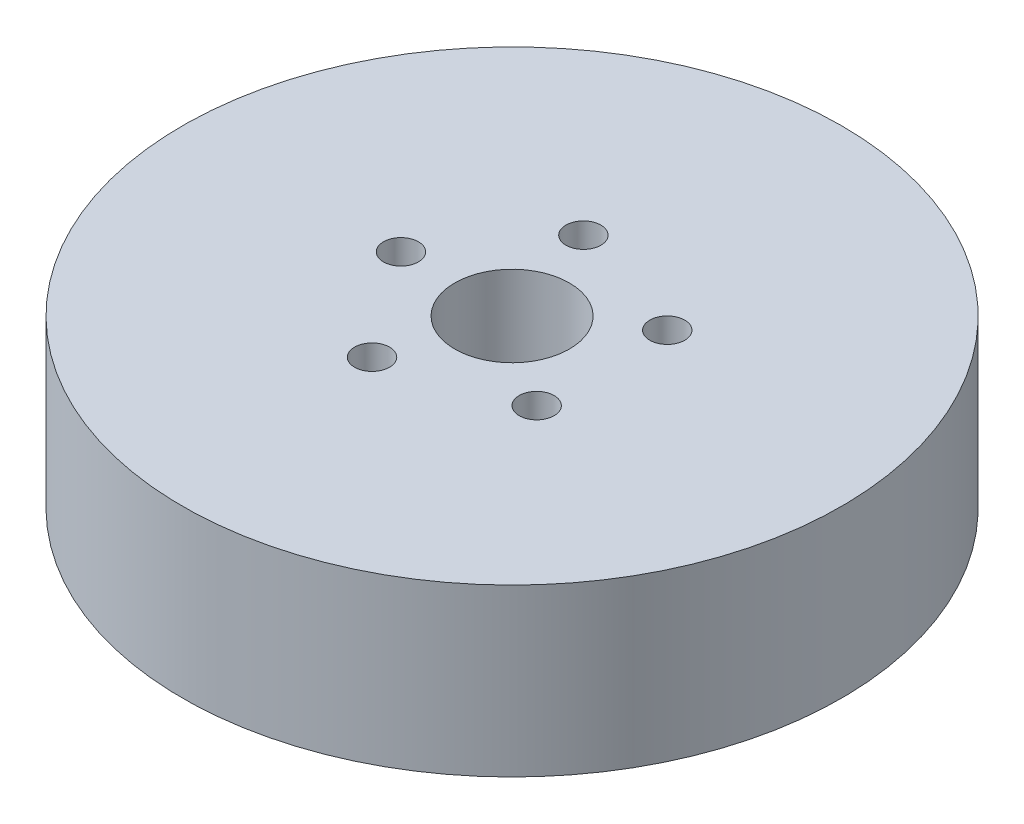
ISO-10303-21;
HEADER;
FILE_DESCRIPTION(('STEP AP214'),'2;1');
FILE_NAME('part.step','',(''),(''),'','','');
FILE_SCHEMA(('AUTOMOTIVE_DESIGN { 1 0 10303 214 1 1 1 1 }'));
ENDSEC;
DATA;
#1=APPLICATION_CONTEXT('core data for automotive mechanical design processes');
#2=APPLICATION_PROTOCOL_DEFINITION('international standard','automotive_design',2000,#1);
#3=PRODUCT_CONTEXT('',#1,'mechanical');
#4=PRODUCT('Part','Part','',(#3));
#5=PRODUCT_RELATED_PRODUCT_CATEGORY('part','',(#4));
#6=PRODUCT_DEFINITION_FORMATION('','',#4);
#7=PRODUCT_DEFINITION_CONTEXT('part definition',#1,'design');
#8=PRODUCT_DEFINITION('design','',#6,#7);
#9=PRODUCT_DEFINITION_SHAPE('','',#8);
#10=(LENGTH_UNIT() NAMED_UNIT(*) SI_UNIT(.MILLI.,.METRE.));
#11=(NAMED_UNIT(*) PLANE_ANGLE_UNIT() SI_UNIT($,.RADIAN.));
#12=(NAMED_UNIT(*) SI_UNIT($,.STERADIAN.) SOLID_ANGLE_UNIT());
#13=UNCERTAINTY_MEASURE_WITH_UNIT(LENGTH_MEASURE(1.E-05),#10,'distance_accuracy_value','');
#14=(GEOMETRIC_REPRESENTATION_CONTEXT(3) GLOBAL_UNCERTAINTY_ASSIGNED_CONTEXT((#13)) GLOBAL_UNIT_ASSIGNED_CONTEXT((#10,
#11,#12)) REPRESENTATION_CONTEXT('',''));
#15=CARTESIAN_POINT('',(0.,0.,0.));
#16=DIRECTION('',(0.,0.,1.));
#17=DIRECTION('',(1.,0.,0.));
#18=AXIS2_PLACEMENT_3D('',#15,#16,#17);
#19=CARTESIAN_POINT('',(0.,29.,0.));
#20=DIRECTION('',(0.,-1.,0.));
#21=DIRECTION('',(0.,0.,-1.));
#22=AXIS2_PLACEMENT_3D('',#19,#20,#21);
#23=CYLINDRICAL_SURFACE('',#22,57.5);
#24=CARTESIAN_POINT('',(0.,29.,0.));
#25=DIRECTION('',(0.,1.,0.));
#26=DIRECTION('',(0.,0.,1.));
#27=AXIS2_PLACEMENT_3D('',#24,#25,#26);
#28=CIRCLE('',#27,57.5);
#29=CARTESIAN_POINT('',(0.,29.,-57.5));
#30=VERTEX_POINT('',#29);
#31=EDGE_CURVE('E10',#30,#30,#28,.T.);
#32=CARTESIAN_POINT('',(0.,0.,0.));
#33=DIRECTION('',(0.,1.,0.));
#34=DIRECTION('',(0.,0.,1.));
#35=AXIS2_PLACEMENT_3D('',#32,#33,#34);
#36=CIRCLE('',#35,57.5);
#37=CARTESIAN_POINT('',(0.,0.,-57.5));
#38=VERTEX_POINT('',#37);
#39=EDGE_CURVE('E37',#38,#38,#36,.T.);
#40=CARTESIAN_POINT('',(0.,29.,-57.5));
#41=CARTESIAN_POINT('',(0.,28.6979166666667,-57.5));
#42=CARTESIAN_POINT('',(0.,28.3958333333333,-57.5));
#43=CARTESIAN_POINT('',(0.,27.7916666666667,-57.5));
#44=CARTESIAN_POINT('',(0.,27.4895833333333,-57.5));
#45=CARTESIAN_POINT('',(0.,26.8854166666667,-57.5));
#46=CARTESIAN_POINT('',(0.,26.5833333333333,-57.5));
#47=CARTESIAN_POINT('',(0.,25.9791666666667,-57.5));
#48=CARTESIAN_POINT('',(0.,25.6770833333333,-57.5));
#49=CARTESIAN_POINT('',(0.,25.0729166666667,-57.5));
#50=CARTESIAN_POINT('',(0.,24.7708333333333,-57.5));
#51=CARTESIAN_POINT('',(0.,24.1666666666667,-57.5));
#52=CARTESIAN_POINT('',(0.,23.8645833333333,-57.5));
#53=CARTESIAN_POINT('',(0.,23.2604166666667,-57.5));
#54=CARTESIAN_POINT('',(0.,22.9583333333333,-57.5));
#55=CARTESIAN_POINT('',(0.,22.3541666666667,-57.5));
#56=CARTESIAN_POINT('',(0.,22.0520833333333,-57.5));
#57=CARTESIAN_POINT('',(0.,21.4479166666667,-57.5));
#58=CARTESIAN_POINT('',(0.,21.1458333333333,-57.5));
#59=CARTESIAN_POINT('',(0.,20.5416666666667,-57.5));
#60=CARTESIAN_POINT('',(0.,20.2395833333333,-57.5));
#61=CARTESIAN_POINT('',(0.,19.6354166666667,-57.5));
#62=CARTESIAN_POINT('',(0.,19.3333333333333,-57.5));
#63=CARTESIAN_POINT('',(0.,18.7291666666667,-57.5));
#64=CARTESIAN_POINT('',(0.,18.4270833333333,-57.5));
#65=CARTESIAN_POINT('',(0.,17.8229166666667,-57.5));
#66=CARTESIAN_POINT('',(0.,17.5208333333333,-57.5));
#67=CARTESIAN_POINT('',(0.,16.9166666666667,-57.5));
#68=CARTESIAN_POINT('',(0.,16.6145833333333,-57.5));
#69=CARTESIAN_POINT('',(0.,16.0104166666667,-57.5));
#70=CARTESIAN_POINT('',(0.,15.7083333333333,-57.5));
#71=CARTESIAN_POINT('',(0.,15.1041666666667,-57.5));
#72=CARTESIAN_POINT('',(0.,14.8020833333333,-57.5));
#73=CARTESIAN_POINT('',(0.,14.1979166666667,-57.5));
#74=CARTESIAN_POINT('',(0.,13.8958333333333,-57.5));
#75=CARTESIAN_POINT('',(0.,13.2916666666667,-57.5));
#76=CARTESIAN_POINT('',(0.,12.9895833333333,-57.5));
#77=CARTESIAN_POINT('',(0.,12.3854166666667,-57.5));
#78=CARTESIAN_POINT('',(0.,12.0833333333333,-57.5));
#79=CARTESIAN_POINT('',(0.,11.4791666666667,-57.5));
#80=CARTESIAN_POINT('',(0.,11.1770833333333,-57.5));
#81=CARTESIAN_POINT('',(0.,10.5729166666667,-57.5));
#82=CARTESIAN_POINT('',(0.,10.2708333333333,-57.5));
#83=CARTESIAN_POINT('',(0.,9.66666666666667,-57.5));
#84=CARTESIAN_POINT('',(0.,9.36458333333333,-57.5));
#85=CARTESIAN_POINT('',(0.,8.76041666666667,-57.5));
#86=CARTESIAN_POINT('',(0.,8.45833333333333,-57.5));
#87=CARTESIAN_POINT('',(0.,7.85416666666667,-57.5));
#88=CARTESIAN_POINT('',(0.,7.55208333333333,-57.5));
#89=CARTESIAN_POINT('',(0.,6.94791666666667,-57.5));
#90=CARTESIAN_POINT('',(0.,6.64583333333333,-57.5));
#91=CARTESIAN_POINT('',(0.,6.04166666666667,-57.5));
#92=CARTESIAN_POINT('',(0.,5.73958333333333,-57.5));
#93=CARTESIAN_POINT('',(0.,5.13541666666667,-57.5));
#94=CARTESIAN_POINT('',(0.,4.83333333333333,-57.5));
#95=CARTESIAN_POINT('',(0.,4.22916666666667,-57.5));
#96=CARTESIAN_POINT('',(0.,3.92708333333333,-57.5));
#97=CARTESIAN_POINT('',(0.,3.32291666666667,-57.5));
#98=CARTESIAN_POINT('',(0.,3.02083333333333,-57.5));
#99=CARTESIAN_POINT('',(0.,2.41666666666667,-57.5));
#100=CARTESIAN_POINT('',(0.,2.11458333333333,-57.5));
#101=CARTESIAN_POINT('',(0.,1.51041666666667,-57.5));
#102=CARTESIAN_POINT('',(0.,1.20833333333333,-57.5));
#103=CARTESIAN_POINT('',(0.,0.604166666666667,-57.5));
#104=CARTESIAN_POINT('',(0.,0.302083333333333,-57.5));
#105=CARTESIAN_POINT('',(0.,0.,-57.5));
#106=B_SPLINE_CURVE_WITH_KNOTS('',3,(#40,#41,#42,#43,#44,#45,#46,#47,#48,#49,#50,#51,#52,#53,
#54,#55,#56,#57,#58,#59,#60,#61,#62,#63,#64,#65,#66,#67,#68,#69,#70,#71,#72,#73,#74,#75,#76,#77,
#78,#79,#80,#81,#82,#83,#84,#85,#86,#87,#88,#89,#90,#91,#92,#93,#94,#95,#96,#97,#98,#99,#100,
#101,#102,#103,#104,#105),.UNSPECIFIED.,.F.,.F.,(4,2,2,2,2,2,2,2,2,2,2,2,2,2,2,2,2,2,2,2,2,2,2,
2,2,2,2,2,2,2,2,2,4),(0.,0.906250000000001,1.8125,2.71875,3.625,4.53125,5.4375,6.34375,7.25,
8.15625,9.0625,9.96875,10.875,11.78125,12.6875,13.59375,14.5,15.40625,16.3125,17.21875,18.125,
19.03125,19.9375,20.84375,21.75,22.65625,23.5625,24.46875,25.375,26.28125,27.1875,28.09375,29.),.UNSPECIFIED.);
#107=EDGE_CURVE('BSEAM40',#30,#38,#106,.T.);
#108=ORIENTED_EDGE('',*,*,#31,.F.);
#109=ORIENTED_EDGE('',*,*,#39,.T.);
#110=ORIENTED_EDGE('',*,*,#107,.T.);
#111=ORIENTED_EDGE('',*,*,#107,.F.);
#112=EDGE_LOOP('',(#108,#110,#109,#111));
#113=FACE_BOUND('',#112,.T.);
#114=ADVANCED_FACE('F40',(#113),#23,.T.);
#115=CARTESIAN_POINT('',(0.,29.,0.));
#116=DIRECTION('',(0.,1.,0.));
#117=DIRECTION('',(0.,0.,1.));
#118=AXIS2_PLACEMENT_3D('',#115,#116,#117);
#119=PLANE('',#118);
#120=CARTESIAN_POINT('',(-5.99086119774764,29.,18.4379748818101));
#121=DIRECTION('',(0.,1.,0.));
#122=DIRECTION('',(0.951056516295155,0.,0.309016994374945));
#123=AXIS2_PLACEMENT_3D('',#120,#121,#122);
#124=CIRCLE('',#123,3.05006748718573);
#125=CARTESIAN_POINT('',(-3.09007463891966,29.,19.380497569341));
#126=VERTEX_POINT('',#125);
#127=EDGE_CURVE('E78',#126,#126,#124,.T.);
#128=ORIENTED_EDGE('',*,*,#127,.F.);
#129=EDGE_LOOP('',(#128));
#130=FACE_BOUND('',#129,.T.);
#131=CARTESIAN_POINT('',(15.6842782375864,29.,11.3952951606754));
#132=DIRECTION('',(0.,1.,0.));
#133=DIRECTION('',(0.587785252292469,0.,-0.809016994374951));
#134=AXIS2_PLACEMENT_3D('',#131,#132,#133);
#135=CIRCLE('',#134,3.05006748718573);
#136=CARTESIAN_POINT('',(17.4770629250509,29.,8.92773872955161));
#137=VERTEX_POINT('',#136);
#138=EDGE_CURVE('E71',#137,#137,#135,.T.);
#139=ORIENTED_EDGE('',*,*,#138,.F.);
#140=EDGE_LOOP('',(#139));
#141=FACE_BOUND('',#140,.T.);
#142=CARTESIAN_POINT('',(15.6842782375862,29.,-11.3952951606756));
#143=DIRECTION('',(0.,1.,0.));
#144=DIRECTION('',(-0.58778525229248,0.,-0.809016994374942));
#145=AXIS2_PLACEMENT_3D('',#142,#143,#144);
#146=CIRCLE('',#145,3.05006748718573);
#147=CARTESIAN_POINT('',(13.8914935501217,29.,-13.8628515917993));
#148=VERTEX_POINT('',#147);
#149=EDGE_CURVE('E70',#148,#148,#146,.T.);
#150=ORIENTED_EDGE('',*,*,#149,.F.);
#151=EDGE_LOOP('',(#150));
#152=FACE_BOUND('',#151,.T.);
#153=CARTESIAN_POINT('',(-5.9908611977479,29.,-18.43797488181));
#154=DIRECTION('',(0.,1.,0.));
#155=DIRECTION('',(-0.95105651629515,0.,0.309016994374958));
#156=AXIS2_PLACEMENT_3D('',#153,#154,#155);
#157=CIRCLE('',#156,3.05006748718573);
#158=CARTESIAN_POINT('',(-8.89164775657586,29.,-17.4954521942791));
#159=VERTEX_POINT('',#158);
#160=EDGE_CURVE('E61',#159,#159,#157,.T.);
#161=ORIENTED_EDGE('',*,*,#160,.F.);
#162=EDGE_LOOP('',(#161));
#163=FACE_BOUND('',#162,.T.);
#164=CARTESIAN_POINT('',(-19.3868340796773,29.,0.));
#165=DIRECTION('',(0.,1.,0.));
#166=DIRECTION('',(0.,0.,1.));
#167=AXIS2_PLACEMENT_3D('',#164,#165,#166);
#168=CIRCLE('',#167,3.05006748718573);
#169=CARTESIAN_POINT('',(-19.3868340796773,29.,3.05006748718573));
#170=VERTEX_POINT('',#169);
#171=EDGE_CURVE('E54',#170,#170,#168,.T.);
#172=ORIENTED_EDGE('',*,*,#171,.F.);
#173=EDGE_LOOP('',(#172));
#174=FACE_BOUND('',#173,.T.);
#175=CARTESIAN_POINT('',(0.,29.,0.));
#176=DIRECTION('',(0.,1.,0.));
#177=DIRECTION('',(0.,0.,1.));
#178=AXIS2_PLACEMENT_3D('',#175,#176,#177);
#179=CIRCLE('',#178,10.);
#180=CARTESIAN_POINT('',(0.,29.,-10.));
#181=VERTEX_POINT('',#180);
#182=EDGE_CURVE('E50',#181,#181,#179,.T.);
#183=ORIENTED_EDGE('',*,*,#182,.F.);
#184=EDGE_LOOP('',(#183));
#185=FACE_BOUND('',#184,.T.);
#186=ORIENTED_EDGE('',*,*,#31,.T.);
#187=EDGE_LOOP('',(#186));
#188=FACE_BOUND('',#187,.T.);
#189=ADVANCED_FACE('F94',(#130,#141,#152,#163,#174,#185,#188),#119,.T.);
#190=CARTESIAN_POINT('',(0.,0.,0.));
#191=DIRECTION('',(0.,1.,0.));
#192=DIRECTION('',(0.,0.,1.));
#193=AXIS2_PLACEMENT_3D('',#190,#191,#192);
#194=PLANE('',#193);
#195=CARTESIAN_POINT('',(0.,0.,0.));
#196=DIRECTION('',(0.,1.,0.));
#197=DIRECTION('',(0.,0.,1.));
#198=AXIS2_PLACEMENT_3D('',#195,#196,#197);
#199=CIRCLE('',#198,10.);
#200=CARTESIAN_POINT('',(0.,0.,-10.));
#201=VERTEX_POINT('',#200);
#202=EDGE_CURVE('E47',#201,#201,#199,.T.);
#203=ORIENTED_EDGE('',*,*,#202,.T.);
#204=EDGE_LOOP('',(#203));
#205=FACE_BOUND('',#204,.T.);
#206=ORIENTED_EDGE('',*,*,#39,.F.);
#207=EDGE_LOOP('',(#206));
#208=FACE_BOUND('',#207,.T.);
#209=ADVANCED_FACE('F100',(#205,#208),#194,.F.);
#210=CARTESIAN_POINT('',(0.,29.,0.));
#211=DIRECTION('',(0.,-1.,0.));
#212=DIRECTION('',(0.,0.,-1.));
#213=AXIS2_PLACEMENT_3D('',#210,#211,#212);
#214=CYLINDRICAL_SURFACE('',#213,10.);
#215=CARTESIAN_POINT('',(0.,29.,-10.));
#216=CARTESIAN_POINT('',(0.,28.6979166666667,-10.));
#217=CARTESIAN_POINT('',(0.,28.3958333333333,-10.));
#218=CARTESIAN_POINT('',(0.,27.7916666666667,-10.));
#219=CARTESIAN_POINT('',(0.,27.4895833333333,-10.));
#220=CARTESIAN_POINT('',(0.,26.8854166666667,-10.));
#221=CARTESIAN_POINT('',(0.,26.5833333333333,-10.));
#222=CARTESIAN_POINT('',(0.,25.9791666666667,-10.));
#223=CARTESIAN_POINT('',(0.,25.6770833333333,-10.));
#224=CARTESIAN_POINT('',(0.,25.0729166666667,-10.));
#225=CARTESIAN_POINT('',(0.,24.7708333333333,-10.));
#226=CARTESIAN_POINT('',(0.,24.1666666666667,-10.));
#227=CARTESIAN_POINT('',(0.,23.8645833333333,-10.));
#228=CARTESIAN_POINT('',(0.,23.2604166666667,-10.));
#229=CARTESIAN_POINT('',(0.,22.9583333333333,-10.));
#230=CARTESIAN_POINT('',(0.,22.3541666666667,-10.));
#231=CARTESIAN_POINT('',(0.,22.0520833333333,-10.));
#232=CARTESIAN_POINT('',(0.,21.4479166666667,-10.));
#233=CARTESIAN_POINT('',(0.,21.1458333333333,-10.));
#234=CARTESIAN_POINT('',(0.,20.5416666666667,-10.));
#235=CARTESIAN_POINT('',(0.,20.2395833333333,-10.));
#236=CARTESIAN_POINT('',(0.,19.6354166666667,-10.));
#237=CARTESIAN_POINT('',(0.,19.3333333333333,-10.));
#238=CARTESIAN_POINT('',(0.,18.7291666666667,-10.));
#239=CARTESIAN_POINT('',(0.,18.4270833333333,-10.));
#240=CARTESIAN_POINT('',(0.,17.8229166666667,-10.));
#241=CARTESIAN_POINT('',(0.,17.5208333333333,-10.));
#242=CARTESIAN_POINT('',(0.,16.9166666666667,-10.));
#243=CARTESIAN_POINT('',(0.,16.6145833333333,-10.));
#244=CARTESIAN_POINT('',(0.,16.0104166666667,-10.));
#245=CARTESIAN_POINT('',(0.,15.7083333333333,-10.));
#246=CARTESIAN_POINT('',(0.,15.1041666666667,-10.));
#247=CARTESIAN_POINT('',(0.,14.8020833333333,-10.));
#248=CARTESIAN_POINT('',(0.,14.1979166666667,-10.));
#249=CARTESIAN_POINT('',(0.,13.8958333333333,-10.));
#250=CARTESIAN_POINT('',(0.,13.2916666666667,-10.));
#251=CARTESIAN_POINT('',(0.,12.9895833333333,-10.));
#252=CARTESIAN_POINT('',(0.,12.3854166666667,-10.));
#253=CARTESIAN_POINT('',(0.,12.0833333333333,-10.));
#254=CARTESIAN_POINT('',(0.,11.4791666666667,-10.));
#255=CARTESIAN_POINT('',(0.,11.1770833333333,-10.));
#256=CARTESIAN_POINT('',(0.,10.5729166666667,-10.));
#257=CARTESIAN_POINT('',(0.,10.2708333333333,-10.));
#258=CARTESIAN_POINT('',(0.,9.66666666666667,-10.));
#259=CARTESIAN_POINT('',(0.,9.36458333333333,-10.));
#260=CARTESIAN_POINT('',(0.,8.76041666666667,-10.));
#261=CARTESIAN_POINT('',(0.,8.45833333333333,-10.));
#262=CARTESIAN_POINT('',(0.,7.85416666666667,-10.));
#263=CARTESIAN_POINT('',(0.,7.55208333333333,-10.));
#264=CARTESIAN_POINT('',(0.,6.94791666666667,-10.));
#265=CARTESIAN_POINT('',(0.,6.64583333333333,-10.));
#266=CARTESIAN_POINT('',(0.,6.04166666666667,-10.));
#267=CARTESIAN_POINT('',(0.,5.73958333333333,-10.));
#268=CARTESIAN_POINT('',(0.,5.13541666666667,-10.));
#269=CARTESIAN_POINT('',(0.,4.83333333333333,-10.));
#270=CARTESIAN_POINT('',(0.,4.22916666666667,-10.));
#271=CARTESIAN_POINT('',(0.,3.92708333333333,-10.));
#272=CARTESIAN_POINT('',(0.,3.32291666666667,-10.));
#273=CARTESIAN_POINT('',(0.,3.02083333333333,-10.));
#274=CARTESIAN_POINT('',(0.,2.41666666666667,-10.));
#275=CARTESIAN_POINT('',(0.,2.11458333333333,-10.));
#276=CARTESIAN_POINT('',(0.,1.51041666666667,-10.));
#277=CARTESIAN_POINT('',(0.,1.20833333333333,-10.));
#278=CARTESIAN_POINT('',(0.,0.604166666666667,-10.));
#279=CARTESIAN_POINT('',(0.,0.302083333333333,-10.));
#280=CARTESIAN_POINT('',(0.,0.,-10.));
#281=B_SPLINE_CURVE_WITH_KNOTS('',3,(#215,#216,#217,#218,#219,#220,#221,#222,#223,#224,#225,
#226,#227,#228,#229,#230,#231,#232,#233,#234,#235,#236,#237,#238,#239,#240,#241,#242,#243,#244,
#245,#246,#247,#248,#249,#250,#251,#252,#253,#254,#255,#256,#257,#258,#259,#260,#261,#262,#263,
#264,#265,#266,#267,#268,#269,#270,#271,#272,#273,#274,#275,#276,#277,#278,#279,#280),
.UNSPECIFIED.,.F.,.F.,(4,2,2,2,2,2,2,2,2,2,2,2,2,2,2,2,2,2,2,2,2,2,2,2,2,2,2,2,2,2,2,2,4),(0.,
0.906250000000001,1.8125,2.71875,3.625,4.53125,5.4375,6.34375,7.25,8.15625,9.0625,9.96875,
10.875,11.78125,12.6875,13.59375,14.5,15.40625,16.3125,17.21875,18.125,19.03125,19.9375,
20.84375,21.75,22.65625,23.5625,24.46875,25.375,26.28125,27.1875,28.09375,29.),.UNSPECIFIED.);
#282=EDGE_CURVE('BSEAM108',#181,#201,#281,.T.);
#283=ORIENTED_EDGE('',*,*,#182,.T.);
#284=ORIENTED_EDGE('',*,*,#202,.F.);
#285=ORIENTED_EDGE('',*,*,#282,.T.);
#286=ORIENTED_EDGE('',*,*,#282,.F.);
#287=EDGE_LOOP('',(#283,#285,#284,#286));
#288=FACE_BOUND('',#287,.T.);
#289=ADVANCED_FACE('F108',(#288),#214,.F.);
#290=CARTESIAN_POINT('',(-19.3868340796773,10.1873380767061,0.));
#291=DIRECTION('',(0.,1.,0.));
#292=DIRECTION('',(0.,0.,1.));
#293=AXIS2_PLACEMENT_3D('',#290,#291,#292);
#294=CYLINDRICAL_SURFACE('',#293,3.05006748718573);
#295=CARTESIAN_POINT('',(-19.3868340796773,10.1873380767061,0.));
#296=DIRECTION('',(0.,1.,0.));
#297=DIRECTION('',(0.,0.,1.));
#298=AXIS2_PLACEMENT_3D('',#295,#296,#297);
#299=CIRCLE('',#298,3.05006748718573);
#300=CARTESIAN_POINT('',(-19.3868340796773,10.1873380767061,3.05006748718573));
#301=VERTEX_POINT('',#300);
#302=EDGE_CURVE('E55',#301,#301,#299,.T.);
#303=ORIENTED_EDGE('',*,*,#302,.F.);
#304=EDGE_LOOP('',(#303));
#305=FACE_BOUND('',#304,.T.);
#306=ORIENTED_EDGE('',*,*,#171,.T.);
#307=EDGE_LOOP('',(#306));
#308=FACE_BOUND('',#307,.T.);
#309=ADVANCED_FACE('F115',(#305,#308),#294,.F.);
#310=CARTESIAN_POINT('',(-19.3868340796773,10.1873380767061,0.));
#311=DIRECTION('',(0.,1.,0.));
#312=DIRECTION('',(0.,0.,1.));
#313=AXIS2_PLACEMENT_3D('',#310,#311,#312);
#314=PLANE('',#313);
#315=ORIENTED_EDGE('',*,*,#302,.T.);
#316=EDGE_LOOP('',(#315));
#317=FACE_BOUND('',#316,.T.);
#318=ADVANCED_FACE('F142',(#317),#314,.T.);
#319=CARTESIAN_POINT('',(-5.9908611977479,10.1873380767061,-18.43797488181));
#320=DIRECTION('',(0.,1.,0.));
#321=DIRECTION('',(0.,0.,1.));
#322=AXIS2_PLACEMENT_3D('',#319,#320,#321);
#323=CYLINDRICAL_SURFACE('',#322,3.05006748718573);
#324=CARTESIAN_POINT('',(-5.9908611977479,10.1873380767061,-18.43797488181));
#325=DIRECTION('',(0.,1.,0.));
#326=DIRECTION('',(-0.95105651629515,0.,0.309016994374958));
#327=AXIS2_PLACEMENT_3D('',#324,#325,#326);
#328=CIRCLE('',#327,3.05006748718573);
#329=CARTESIAN_POINT('',(-8.89164775657586,10.1873380767061,-17.4954521942791));
#330=VERTEX_POINT('',#329);
#331=EDGE_CURVE('E63',#330,#330,#328,.T.);
#332=ORIENTED_EDGE('',*,*,#331,.F.);
#333=EDGE_LOOP('',(#332));
#334=FACE_BOUND('',#333,.T.);
#335=ORIENTED_EDGE('',*,*,#160,.T.);
#336=EDGE_LOOP('',(#335));
#337=FACE_BOUND('',#336,.T.);
#338=ADVANCED_FACE('F147',(#334,#337),#323,.F.);
#339=CARTESIAN_POINT('',(-5.9908611977479,10.1873380767061,-18.43797488181));
#340=DIRECTION('',(0.,1.,0.));
#341=DIRECTION('',(-0.95105651629515,0.,0.309016994374958));
#342=AXIS2_PLACEMENT_3D('',#339,#340,#341);
#343=PLANE('',#342);
#344=ORIENTED_EDGE('',*,*,#331,.T.);
#345=EDGE_LOOP('',(#344));
#346=FACE_BOUND('',#345,.T.);
#347=ADVANCED_FACE('F163',(#346),#343,.T.);
#348=CARTESIAN_POINT('',(15.6842782375862,10.1873380767061,-11.3952951606756));
#349=DIRECTION('',(0.,1.,0.));
#350=DIRECTION('',(0.,0.,1.));
#351=AXIS2_PLACEMENT_3D('',#348,#349,#350);
#352=CYLINDRICAL_SURFACE('',#351,3.05006748718573);
#353=CARTESIAN_POINT('',(15.6842782375862,10.1873380767061,-11.3952951606756));
#354=DIRECTION('',(0.,1.,0.));
#355=DIRECTION('',(-0.58778525229248,0.,-0.809016994374942));
#356=AXIS2_PLACEMENT_3D('',#353,#354,#355);
#357=CIRCLE('',#356,3.05006748718573);
#358=CARTESIAN_POINT('',(13.8914935501217,10.1873380767061,-13.8628515917993));
#359=VERTEX_POINT('',#358);
#360=EDGE_CURVE('E69',#359,#359,#357,.T.);
#361=ORIENTED_EDGE('',*,*,#360,.F.);
#362=EDGE_LOOP('',(#361));
#363=FACE_BOUND('',#362,.T.);
#364=ORIENTED_EDGE('',*,*,#149,.T.);
#365=EDGE_LOOP('',(#364));
#366=FACE_BOUND('',#365,.T.);
#367=ADVANCED_FACE('F172',(#363,#366),#352,.F.);
#368=CARTESIAN_POINT('',(15.6842782375862,10.1873380767061,-11.3952951606756));
#369=DIRECTION('',(0.,1.,0.));
#370=DIRECTION('',(-0.58778525229248,0.,-0.809016994374942));
#371=AXIS2_PLACEMENT_3D('',#368,#369,#370);
#372=PLANE('',#371);
#373=ORIENTED_EDGE('',*,*,#360,.T.);
#374=EDGE_LOOP('',(#373));
#375=FACE_BOUND('',#374,.T.);
#376=ADVANCED_FACE('F185',(#375),#372,.T.);
#377=CARTESIAN_POINT('',(15.6842782375864,10.1873380767061,11.3952951606754));
#378=DIRECTION('',(0.,1.,0.));
#379=DIRECTION('',(0.,0.,1.));
#380=AXIS2_PLACEMENT_3D('',#377,#378,#379);
#381=CYLINDRICAL_SURFACE('',#380,3.05006748718573);
#382=CARTESIAN_POINT('',(15.6842782375864,10.1873380767061,11.3952951606754));
#383=DIRECTION('',(0.,1.,0.));
#384=DIRECTION('',(0.587785252292469,0.,-0.809016994374951));
#385=AXIS2_PLACEMENT_3D('',#382,#383,#384);
#386=CIRCLE('',#385,3.05006748718573);
#387=CARTESIAN_POINT('',(17.4770629250509,10.1873380767061,8.92773872955161));
#388=VERTEX_POINT('',#387);
#389=EDGE_CURVE('E76',#388,#388,#386,.T.);
#390=ORIENTED_EDGE('',*,*,#389,.F.);
#391=EDGE_LOOP('',(#390));
#392=FACE_BOUND('',#391,.T.);
#393=ORIENTED_EDGE('',*,*,#138,.T.);
#394=EDGE_LOOP('',(#393));
#395=FACE_BOUND('',#394,.T.);
#396=ADVANCED_FACE('F191',(#392,#395),#381,.F.);
#397=CARTESIAN_POINT('',(15.6842782375864,10.1873380767061,11.3952951606754));
#398=DIRECTION('',(0.,1.,0.));
#399=DIRECTION('',(0.587785252292469,0.,-0.809016994374951));
#400=AXIS2_PLACEMENT_3D('',#397,#398,#399);
#401=PLANE('',#400);
#402=ORIENTED_EDGE('',*,*,#389,.T.);
#403=EDGE_LOOP('',(#402));
#404=FACE_BOUND('',#403,.T.);
#405=ADVANCED_FACE('F89',(#404),#401,.T.);
#406=CARTESIAN_POINT('',(-5.99086119774764,10.1873380767061,18.4379748818101));
#407=DIRECTION('',(0.,1.,0.));
#408=DIRECTION('',(0.,0.,1.));
#409=AXIS2_PLACEMENT_3D('',#406,#407,#408);
#410=CYLINDRICAL_SURFACE('',#409,3.05006748718573);
#411=CARTESIAN_POINT('',(-5.99086119774764,10.1873380767061,18.4379748818101));
#412=DIRECTION('',(0.,1.,0.));
#413=DIRECTION('',(0.951056516295155,0.,0.309016994374945));
#414=AXIS2_PLACEMENT_3D('',#411,#412,#413);
#415=CIRCLE('',#414,3.05006748718573);
#416=CARTESIAN_POINT('',(-3.09007463891966,10.1873380767061,19.380497569341));
#417=VERTEX_POINT('',#416);
#418=EDGE_CURVE('E59',#417,#417,#415,.T.);
#419=ORIENTED_EDGE('',*,*,#418,.F.);
#420=EDGE_LOOP('',(#419));
#421=FACE_BOUND('',#420,.T.);
#422=ORIENTED_EDGE('',*,*,#127,.T.);
#423=EDGE_LOOP('',(#422));
#424=FACE_BOUND('',#423,.T.);
#425=ADVANCED_FACE('F87',(#421,#424),#410,.F.);
#426=CARTESIAN_POINT('',(-5.99086119774764,10.1873380767061,18.4379748818101));
#427=DIRECTION('',(0.,1.,0.));
#428=DIRECTION('',(0.951056516295155,0.,0.309016994374945));
#429=AXIS2_PLACEMENT_3D('',#426,#427,#428);
#430=PLANE('',#429);
#431=ORIENTED_EDGE('',*,*,#418,.T.);
#432=EDGE_LOOP('',(#431));
#433=FACE_BOUND('',#432,.T.);
#434=ADVANCED_FACE('F84',(#433),#430,.T.);
#435=CLOSED_SHELL('',(#114,#189,#209,#289,#309,#318,#338,#347,#367,#376,#396,#405,#425,#434));
#436=MANIFOLD_SOLID_BREP('B2',#435);
#437=ADVANCED_BREP_SHAPE_REPRESENTATION('',(#18,#436),#14);
#438=SHAPE_DEFINITION_REPRESENTATION(#9,#437);
ENDSEC;
END-ISO-10303-21;
